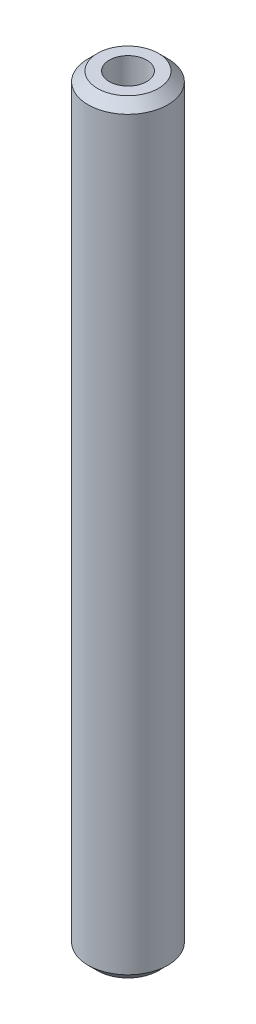
ISO-10303-21;
HEADER;
FILE_DESCRIPTION(('STEP AP214'),'2;1');
FILE_NAME('part.step','',(''),(''),'','','');
FILE_SCHEMA(('AUTOMOTIVE_DESIGN { 1 0 10303 214 1 1 1 1 }'));
ENDSEC;
DATA;
#1=APPLICATION_CONTEXT('core data for automotive mechanical design processes');
#2=APPLICATION_PROTOCOL_DEFINITION('international standard','automotive_design',2000,#1);
#3=PRODUCT_CONTEXT('',#1,'mechanical');
#4=PRODUCT('Part','Part','',(#3));
#5=PRODUCT_RELATED_PRODUCT_CATEGORY('part','',(#4));
#6=PRODUCT_DEFINITION_FORMATION('','',#4);
#7=PRODUCT_DEFINITION_CONTEXT('part definition',#1,'design');
#8=PRODUCT_DEFINITION('design','',#6,#7);
#9=PRODUCT_DEFINITION_SHAPE('','',#8);
#10=(LENGTH_UNIT() NAMED_UNIT(*) SI_UNIT(.MILLI.,.METRE.));
#11=(NAMED_UNIT(*) PLANE_ANGLE_UNIT() SI_UNIT($,.RADIAN.));
#12=(NAMED_UNIT(*) SI_UNIT($,.STERADIAN.) SOLID_ANGLE_UNIT());
#13=UNCERTAINTY_MEASURE_WITH_UNIT(LENGTH_MEASURE(1.E-05),#10,'distance_accuracy_value','');
#14=(GEOMETRIC_REPRESENTATION_CONTEXT(3) GLOBAL_UNCERTAINTY_ASSIGNED_CONTEXT((#13)) GLOBAL_UNIT_ASSIGNED_CONTEXT((#10,
#11,#12)) REPRESENTATION_CONTEXT('',''));
#15=CARTESIAN_POINT('',(0.,0.,0.));
#16=DIRECTION('',(0.,0.,1.));
#17=DIRECTION('',(1.,0.,0.));
#18=AXIS2_PLACEMENT_3D('',#15,#16,#17);
#19=CARTESIAN_POINT('',(0.,383.081654478119,0.));
#20=DIRECTION('',(0.,-1.,0.));
#21=DIRECTION('',(0.,0.,-1.));
#22=AXIS2_PLACEMENT_3D('',#19,#20,#21);
#23=CYLINDRICAL_SURFACE('',#22,20.);
#24=CARTESIAN_POINT('',(0.,378.353231427874,0.));
#25=DIRECTION('',(0.,1.,0.));
#26=DIRECTION('',(0.,0.,1.));
#27=AXIS2_PLACEMENT_3D('',#24,#25,#26);
#28=CIRCLE('',#27,20.);
#29=CARTESIAN_POINT('',(0.,378.353231427874,20.));
#30=VERTEX_POINT('',#29);
#31=EDGE_CURVE('E50',#30,#30,#28,.F.);
#32=ORIENTED_EDGE('',*,*,#31,.T.);
#33=EDGE_LOOP('',(#32));
#34=FACE_BOUND('',#33,.T.);
#35=CARTESIAN_POINT('',(0.,4.72842305024529,0.));
#36=DIRECTION('',(0.,1.,0.));
#37=DIRECTION('',(0.,0.,1.));
#38=AXIS2_PLACEMENT_3D('',#35,#36,#37);
#39=CIRCLE('',#38,20.);
#40=CARTESIAN_POINT('',(0.,4.72842305024529,20.));
#41=VERTEX_POINT('',#40);
#42=EDGE_CURVE('E51',#41,#41,#39,.T.);
#43=ORIENTED_EDGE('',*,*,#42,.T.);
#44=EDGE_LOOP('',(#43));
#45=FACE_BOUND('',#44,.T.);
#46=ADVANCED_FACE('F39',(#34,#45),#23,.T.);
#47=CARTESIAN_POINT('',(0.,383.081654478119,0.));
#48=DIRECTION('',(0.,1.,0.));
#49=DIRECTION('',(0.,0.,1.));
#50=AXIS2_PLACEMENT_3D('',#47,#48,#49);
#51=PLANE('',#50);
#52=CARTESIAN_POINT('',(0.,383.081654478119,0.));
#53=DIRECTION('',(0.,1.,0.));
#54=DIRECTION('',(0.,0.,1.));
#55=AXIS2_PLACEMENT_3D('',#52,#53,#54);
#56=CIRCLE('',#55,15.2715769497547);
#57=CARTESIAN_POINT('',(0.,383.081654478119,15.2715769497547));
#58=VERTEX_POINT('',#57);
#59=EDGE_CURVE('E54',#58,#58,#56,.T.);
#60=ORIENTED_EDGE('',*,*,#59,.T.);
#61=EDGE_LOOP('',(#60));
#62=FACE_BOUND('',#61,.T.);
#63=CARTESIAN_POINT('',(0.,383.081654478119,0.));
#64=DIRECTION('',(0.,1.,0.));
#65=DIRECTION('',(0.,0.,1.));
#66=AXIS2_PLACEMENT_3D('',#63,#64,#65);
#67=CIRCLE('',#66,9.37268234883035);
#68=CARTESIAN_POINT('',(0.,383.081654478119,9.37268234883035));
#69=VERTEX_POINT('',#68);
#70=EDGE_CURVE('E58',#69,#69,#67,.T.);
#71=ORIENTED_EDGE('',*,*,#70,.F.);
#72=EDGE_LOOP('',(#71));
#73=FACE_BOUND('',#72,.T.);
#74=ADVANCED_FACE('F69',(#62,#73),#51,.T.);
#75=CARTESIAN_POINT('',(0.,0.,0.));
#76=DIRECTION('',(0.,1.,0.));
#77=DIRECTION('',(0.,0.,1.));
#78=AXIS2_PLACEMENT_3D('',#75,#76,#77);
#79=PLANE('',#78);
#80=CARTESIAN_POINT('',(0.,0.,0.));
#81=DIRECTION('',(0.,1.,0.));
#82=DIRECTION('',(0.,0.,1.));
#83=AXIS2_PLACEMENT_3D('',#80,#81,#82);
#84=CIRCLE('',#83,15.2715769497547);
#85=CARTESIAN_POINT('',(0.,0.,15.2715769497547));
#86=VERTEX_POINT('',#85);
#87=EDGE_CURVE('E10',#86,#86,#84,.F.);
#88=ORIENTED_EDGE('',*,*,#87,.T.);
#89=EDGE_LOOP('',(#88));
#90=FACE_BOUND('',#89,.T.);
#91=CARTESIAN_POINT('',(0.,0.,0.));
#92=DIRECTION('',(0.,1.,0.));
#93=DIRECTION('',(0.,0.,1.));
#94=AXIS2_PLACEMENT_3D('',#91,#92,#93);
#95=CIRCLE('',#94,9.37268234883035);
#96=CARTESIAN_POINT('',(0.,0.,9.37268234883035));
#97=VERTEX_POINT('',#96);
#98=EDGE_CURVE('E63',#97,#97,#95,.T.);
#99=ORIENTED_EDGE('',*,*,#98,.T.);
#100=EDGE_LOOP('',(#99));
#101=FACE_BOUND('',#100,.T.);
#102=ADVANCED_FACE('F75',(#90,#101),#79,.F.);
#103=CARTESIAN_POINT('',(0.,383.081654478119,0.));
#104=DIRECTION('',(0.,-1.,0.));
#105=DIRECTION('',(0.,0.,-1.));
#106=AXIS2_PLACEMENT_3D('',#103,#104,#105);
#107=CYLINDRICAL_SURFACE('',#106,9.37268234883035);
#108=ORIENTED_EDGE('',*,*,#70,.T.);
#109=EDGE_LOOP('',(#108));
#110=FACE_BOUND('',#109,.T.);
#111=ORIENTED_EDGE('',*,*,#98,.F.);
#112=EDGE_LOOP('',(#111));
#113=FACE_BOUND('',#112,.T.);
#114=ADVANCED_FACE('F70',(#110,#113),#107,.F.);
#115=CARTESIAN_POINT('',(0.,383.081654478119,0.));
#116=DIRECTION('',(0.,-1.,0.));
#117=DIRECTION('',(0.,0.,-1.));
#118=AXIS2_PLACEMENT_3D('',#115,#116,#117);
#119=CONICAL_SURFACE('',#118,15.2715769497547,0.785398163397447);
#120=ORIENTED_EDGE('',*,*,#31,.F.);
#121=EDGE_LOOP('',(#120));
#122=FACE_BOUND('',#121,.T.);
#123=ORIENTED_EDGE('',*,*,#59,.F.);
#124=EDGE_LOOP('',(#123));
#125=FACE_BOUND('',#124,.T.);
#126=ADVANCED_FACE('F81',(#122,#125),#119,.T.);
#127=CARTESIAN_POINT('',(0.,4.72842305024529,0.));
#128=DIRECTION('',(0.,1.,0.));
#129=DIRECTION('',(0.,0.,1.));
#130=AXIS2_PLACEMENT_3D('',#127,#128,#129);
#131=CONICAL_SURFACE('',#130,20.,0.785398163397452);
#132=ORIENTED_EDGE('',*,*,#87,.F.);
#133=EDGE_LOOP('',(#132));
#134=FACE_BOUND('',#133,.T.);
#135=ORIENTED_EDGE('',*,*,#42,.F.);
#136=EDGE_LOOP('',(#135));
#137=FACE_BOUND('',#136,.T.);
#138=ADVANCED_FACE('F45',(#134,#137),#131,.T.);
#139=CLOSED_SHELL('',(#46,#74,#102,#114,#126,#138));
#140=MANIFOLD_SOLID_BREP('B2',#139);
#141=ADVANCED_BREP_SHAPE_REPRESENTATION('',(#18,#140),#14);
#142=SHAPE_DEFINITION_REPRESENTATION(#9,#141);
ENDSEC;
END-ISO-10303-21;
